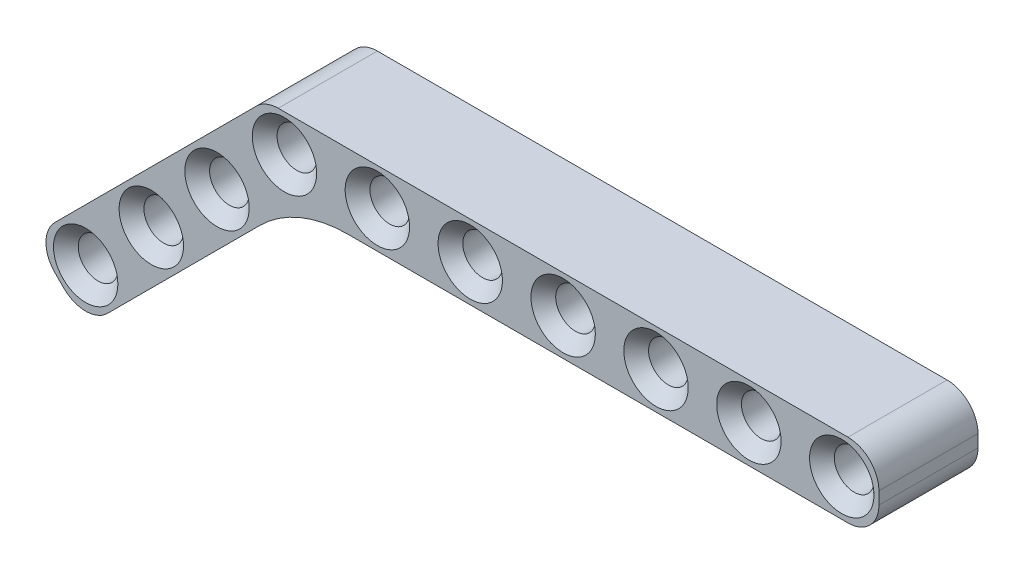
ISO-10303-21;
HEADER;
FILE_DESCRIPTION(('STEP AP214'),'2;1');
FILE_NAME('part.step','',(''),(''),'','','');
FILE_SCHEMA(('AUTOMOTIVE_DESIGN { 1 0 10303 214 1 1 1 1 }'));
ENDSEC;
DATA;
#1=APPLICATION_CONTEXT('core data for automotive mechanical design processes');
#2=APPLICATION_PROTOCOL_DEFINITION('international standard','automotive_design',2000,#1);
#3=PRODUCT_CONTEXT('',#1,'mechanical');
#4=PRODUCT('Part','Part','',(#3));
#5=PRODUCT_RELATED_PRODUCT_CATEGORY('part','',(#4));
#6=PRODUCT_DEFINITION_FORMATION('','',#4);
#7=PRODUCT_DEFINITION_CONTEXT('part definition',#1,'design');
#8=PRODUCT_DEFINITION('design','',#6,#7);
#9=PRODUCT_DEFINITION_SHAPE('','',#8);
#10=(LENGTH_UNIT() NAMED_UNIT(*) SI_UNIT(.MILLI.,.METRE.));
#11=(NAMED_UNIT(*) PLANE_ANGLE_UNIT() SI_UNIT($,.RADIAN.));
#12=(NAMED_UNIT(*) SI_UNIT($,.STERADIAN.) SOLID_ANGLE_UNIT());
#13=UNCERTAINTY_MEASURE_WITH_UNIT(LENGTH_MEASURE(1.E-05),#10,'distance_accuracy_value','');
#14=(GEOMETRIC_REPRESENTATION_CONTEXT(3) GLOBAL_UNCERTAINTY_ASSIGNED_CONTEXT((#13)) GLOBAL_UNIT_ASSIGNED_CONTEXT((#10,
#11,#12)) REPRESENTATION_CONTEXT('',''));
#15=CARTESIAN_POINT('',(0.,0.,0.));
#16=DIRECTION('',(0.,0.,1.));
#17=DIRECTION('',(1.,0.,0.));
#18=AXIS2_PLACEMENT_3D('',#15,#16,#17);
#19=CARTESIAN_POINT('',(-0.5,0.5,8.));
#20=DIRECTION('',(0.,0.,-1.));
#21=DIRECTION('',(-1.,0.,0.));
#22=AXIS2_PLACEMENT_3D('',#19,#20,#21);
#23=CYLINDRICAL_SURFACE('',#22,2.5);
#24=DIRECTION('',(0.,0.,1.));
#25=VECTOR('',#24,1.);
#26=CARTESIAN_POINT('',(-2.26776695296637,2.26776695296637,0.));
#27=LINE('',#26,#25);
#28=CARTESIAN_POINT('',(-2.26776695296637,2.26776695296637,0.));
#29=VERTEX_POINT('',#28);
#30=CARTESIAN_POINT('',(-2.26776695296637,2.26776695296637,8.));
#31=VERTEX_POINT('',#30);
#32=EDGE_CURVE('E172',#29,#31,#27,.T.);
#33=ORIENTED_EDGE('',*,*,#32,.T.);
#34=CARTESIAN_POINT('',(-0.5,0.5,8.));
#35=DIRECTION('',(0.,0.,1.));
#36=DIRECTION('',(1.,0.,0.));
#37=AXIS2_PLACEMENT_3D('',#34,#35,#36);
#38=CIRCLE('',#37,2.5);
#39=CARTESIAN_POINT('',(-0.5,3.,8.));
#40=VERTEX_POINT('',#39);
#41=EDGE_CURVE('E186',#40,#31,#38,.T.);
#42=ORIENTED_EDGE('',*,*,#41,.F.);
#43=DIRECTION('',(0.,0.,-1.));
#44=VECTOR('',#43,1.);
#45=CARTESIAN_POINT('',(-0.5,3.,8.));
#46=LINE('',#45,#44);
#47=CARTESIAN_POINT('',(-0.5,3.,0.));
#48=VERTEX_POINT('',#47);
#49=EDGE_CURVE('E206',#40,#48,#46,.T.);
#50=ORIENTED_EDGE('',*,*,#49,.T.);
#51=CARTESIAN_POINT('',(-0.5,0.5,0.));
#52=DIRECTION('',(0.,0.,1.));
#53=DIRECTION('',(1.,0.,0.));
#54=AXIS2_PLACEMENT_3D('',#51,#52,#53);
#55=CIRCLE('',#54,2.5);
#56=EDGE_CURVE('E200',#48,#29,#55,.T.);
#57=ORIENTED_EDGE('',*,*,#56,.T.);
#58=EDGE_LOOP('',(#33,#42,#50,#57));
#59=FACE_BOUND('',#58,.T.);
#60=ADVANCED_FACE('F35',(#59),#23,.T.);
#61=CARTESIAN_POINT('',(45.5,-0.5,8.));
#62=DIRECTION('',(0.,0.,1.));
#63=DIRECTION('',(1.,0.,0.));
#64=AXIS2_PLACEMENT_3D('',#61,#62,#63);
#65=PLANE('',#64);
#66=CARTESIAN_POINT('',(45.,0.,8.));
#67=DIRECTION('',(0.,0.,1.));
#68=DIRECTION('',(1.,0.,0.));
#69=AXIS2_PLACEMENT_3D('',#66,#67,#68);
#70=CIRCLE('',#69,2.6);
#71=CARTESIAN_POINT('',(47.6,0.,8.));
#72=VERTEX_POINT('',#71);
#73=EDGE_CURVE('E336',#72,#72,#70,.F.);
#74=ORIENTED_EDGE('',*,*,#73,.T.);
#75=EDGE_LOOP('',(#74));
#76=FACE_BOUND('',#75,.T.);
#77=CARTESIAN_POINT('',(37.5,0.,8.));
#78=DIRECTION('',(0.,0.,1.));
#79=DIRECTION('',(1.,0.,0.));
#80=AXIS2_PLACEMENT_3D('',#77,#78,#79);
#81=CIRCLE('',#80,2.6);
#82=CARTESIAN_POINT('',(40.1,0.,8.));
#83=VERTEX_POINT('',#82);
#84=EDGE_CURVE('E333',#83,#83,#81,.F.);
#85=ORIENTED_EDGE('',*,*,#84,.T.);
#86=EDGE_LOOP('',(#85));
#87=FACE_BOUND('',#86,.T.);
#88=CARTESIAN_POINT('',(-16.0543267947628,-15.7614335759495,8.));
#89=DIRECTION('',(0.,0.,1.));
#90=DIRECTION('',(1.,0.,0.));
#91=AXIS2_PLACEMENT_3D('',#88,#89,#90);
#92=CIRCLE('',#91,2.6);
#93=CARTESIAN_POINT('',(-13.4543267947628,-15.7614335759495,8.));
#94=VERTEX_POINT('',#93);
#95=EDGE_CURVE('E297',#94,#94,#92,.F.);
#96=ORIENTED_EDGE('',*,*,#95,.T.);
#97=EDGE_LOOP('',(#96));
#98=FACE_BOUND('',#97,.T.);
#99=CARTESIAN_POINT('',(-10.7510259358637,-10.4581327170504,8.));
#100=DIRECTION('',(0.,0.,1.));
#101=DIRECTION('',(1.,0.,0.));
#102=AXIS2_PLACEMENT_3D('',#99,#100,#101);
#103=CIRCLE('',#102,2.6);
#104=CARTESIAN_POINT('',(-8.15102593586369,-10.4581327170504,8.));
#105=VERTEX_POINT('',#104);
#106=EDGE_CURVE('E294',#105,#105,#103,.F.);
#107=ORIENTED_EDGE('',*,*,#106,.T.);
#108=EDGE_LOOP('',(#107));
#109=FACE_BOUND('',#108,.T.);
#110=CARTESIAN_POINT('',(-5.44772507696464,-5.15483185815121,8.));
#111=DIRECTION('',(0.,0.,1.));
#112=DIRECTION('',(1.,0.,0.));
#113=AXIS2_PLACEMENT_3D('',#110,#111,#112);
#114=CIRCLE('',#113,2.60000000000002);
#115=CARTESIAN_POINT('',(-2.84772507696462,-5.15483185815121,8.));
#116=VERTEX_POINT('',#115);
#117=EDGE_CURVE('E291',#116,#116,#114,.F.);
#118=ORIENTED_EDGE('',*,*,#117,.T.);
#119=EDGE_LOOP('',(#118));
#120=FACE_BOUND('',#119,.T.);
#121=CARTESIAN_POINT('',(30.,0.,8.));
#122=DIRECTION('',(0.,0.,1.));
#123=DIRECTION('',(1.,0.,0.));
#124=AXIS2_PLACEMENT_3D('',#121,#122,#123);
#125=CIRCLE('',#124,2.6);
#126=CARTESIAN_POINT('',(32.6,0.,8.));
#127=VERTEX_POINT('',#126);
#128=EDGE_CURVE('E251',#127,#127,#125,.F.);
#129=ORIENTED_EDGE('',*,*,#128,.T.);
#130=EDGE_LOOP('',(#129));
#131=FACE_BOUND('',#130,.T.);
#132=CARTESIAN_POINT('',(22.5,0.,8.));
#133=DIRECTION('',(0.,0.,1.));
#134=DIRECTION('',(1.,0.,0.));
#135=AXIS2_PLACEMENT_3D('',#132,#133,#134);
#136=CIRCLE('',#135,2.6);
#137=CARTESIAN_POINT('',(25.1,0.,8.));
#138=VERTEX_POINT('',#137);
#139=EDGE_CURVE('E248',#138,#138,#136,.F.);
#140=ORIENTED_EDGE('',*,*,#139,.T.);
#141=EDGE_LOOP('',(#140));
#142=FACE_BOUND('',#141,.T.);
#143=CARTESIAN_POINT('',(15.,0.,8.));
#144=DIRECTION('',(0.,0.,1.));
#145=DIRECTION('',(1.,0.,0.));
#146=AXIS2_PLACEMENT_3D('',#143,#144,#145);
#147=CIRCLE('',#146,2.6);
#148=CARTESIAN_POINT('',(17.6,0.,8.));
#149=VERTEX_POINT('',#148);
#150=EDGE_CURVE('E245',#149,#149,#147,.F.);
#151=ORIENTED_EDGE('',*,*,#150,.T.);
#152=EDGE_LOOP('',(#151));
#153=FACE_BOUND('',#152,.T.);
#154=CARTESIAN_POINT('',(7.5,0.,8.));
#155=DIRECTION('',(0.,0.,1.));
#156=DIRECTION('',(1.,0.,0.));
#157=AXIS2_PLACEMENT_3D('',#154,#155,#156);
#158=CIRCLE('',#157,2.60000000000001);
#159=CARTESIAN_POINT('',(10.1,0.,8.));
#160=VERTEX_POINT('',#159);
#161=EDGE_CURVE('E242',#160,#160,#158,.F.);
#162=ORIENTED_EDGE('',*,*,#161,.T.);
#163=EDGE_LOOP('',(#162));
#164=FACE_BOUND('',#163,.T.);
#165=CARTESIAN_POINT('',(0.,0.,8.));
#166=DIRECTION('',(0.,0.,1.));
#167=DIRECTION('',(1.,0.,0.));
#168=AXIS2_PLACEMENT_3D('',#165,#166,#167);
#169=CIRCLE('',#168,2.60000000000001);
#170=CARTESIAN_POINT('',(2.60000000000001,0.,8.));
#171=VERTEX_POINT('',#170);
#172=EDGE_CURVE('E239',#171,#171,#169,.F.);
#173=ORIENTED_EDGE('',*,*,#172,.T.);
#174=EDGE_LOOP('',(#173));
#175=FACE_BOUND('',#174,.T.);
#176=CARTESIAN_POINT('',(45.5,-0.5,8.));
#177=DIRECTION('',(0.,0.,1.));
#178=DIRECTION('',(1.,0.,0.));
#179=AXIS2_PLACEMENT_3D('',#176,#177,#178);
#180=CIRCLE('',#179,2.5);
#181=CARTESIAN_POINT('',(45.5,-3.,8.));
#182=VERTEX_POINT('',#181);
#183=CARTESIAN_POINT('',(48.,-0.5,8.));
#184=VERTEX_POINT('',#183);
#185=EDGE_CURVE('E176',#182,#184,#180,.T.);
#186=ORIENTED_EDGE('',*,*,#185,.T.);
#187=DIRECTION('',(0.,1.,0.));
#188=VECTOR('',#187,1.);
#189=CARTESIAN_POINT('',(48.,0.5,8.));
#190=LINE('',#189,#188);
#191=CARTESIAN_POINT('',(48.,0.5,8.));
#192=VERTEX_POINT('',#191);
#193=EDGE_CURVE('E179',#184,#192,#190,.T.);
#194=ORIENTED_EDGE('',*,*,#193,.T.);
#195=CARTESIAN_POINT('',(45.5,0.5,8.));
#196=DIRECTION('',(0.,0.,1.));
#197=DIRECTION('',(-1.,0.,0.));
#198=AXIS2_PLACEMENT_3D('',#195,#196,#197);
#199=CIRCLE('',#198,2.5);
#200=CARTESIAN_POINT('',(45.5,3.,8.));
#201=VERTEX_POINT('',#200);
#202=EDGE_CURVE('E182',#192,#201,#199,.T.);
#203=ORIENTED_EDGE('',*,*,#202,.T.);
#204=DIRECTION('',(-1.,0.,0.));
#205=VECTOR('',#204,1.);
#206=CARTESIAN_POINT('',(-0.5,3.,8.));
#207=LINE('',#206,#205);
#208=EDGE_CURVE('E184',#201,#40,#207,.T.);
#209=ORIENTED_EDGE('',*,*,#208,.T.);
#210=ORIENTED_EDGE('',*,*,#41,.T.);
#211=DIRECTION('',(-0.707106781186546,-0.707106781186549,0.));
#212=VECTOR('',#211,1.);
#213=CARTESIAN_POINT('',(-2.26776695296637,2.26776695296636,8.));
#214=LINE('',#213,#212);
#215=CARTESIAN_POINT('',(-18.5292005289157,-13.9936666229831,8.));
#216=VERTEX_POINT('',#215);
#217=EDGE_CURVE('E153',#31,#216,#214,.T.);
#218=ORIENTED_EDGE('',*,*,#217,.T.);
#219=CARTESIAN_POINT('',(-16.7614335759494,-15.7614335759494,8.));
#220=DIRECTION('',(0.,0.,1.));
#221=DIRECTION('',(1.,0.,0.));
#222=AXIS2_PLACEMENT_3D('',#219,#220,#221);
#223=CIRCLE('',#222,2.5);
#224=CARTESIAN_POINT('',(-18.5292005289157,-17.5292005289158,8.));
#225=VERTEX_POINT('',#224);
#226=EDGE_CURVE('E150',#216,#225,#223,.T.);
#227=ORIENTED_EDGE('',*,*,#226,.T.);
#228=DIRECTION('',(0.707106781186546,-0.707106781186549,0.));
#229=VECTOR('',#228,1.);
#230=CARTESIAN_POINT('',(-18.0292005289158,-18.0292005289157,8.));
#231=LINE('',#230,#229);
#232=CARTESIAN_POINT('',(-17.8220937477292,-18.2363073101024,8.));
#233=VERTEX_POINT('',#232);
#234=EDGE_CURVE('E161',#225,#233,#231,.T.);
#235=ORIENTED_EDGE('',*,*,#234,.T.);
#236=CARTESIAN_POINT('',(-16.0543267947628,-16.468540357136,8.));
#237=DIRECTION('',(0.,0.,1.));
#238=DIRECTION('',(1.,0.,0.));
#239=AXIS2_PLACEMENT_3D('',#236,#237,#238);
#240=CIRCLE('',#239,2.5);
#241=CARTESIAN_POINT('',(-14.2865598417965,-18.2363073101024,8.));
#242=VERTEX_POINT('',#241);
#243=EDGE_CURVE('E129',#233,#242,#240,.T.);
#244=ORIENTED_EDGE('',*,*,#243,.T.);
#245=DIRECTION('',(0.707106781186546,0.707106781186549,0.));
#246=VECTOR('',#245,1.);
#247=CARTESIAN_POINT('',(1.97487373415292,-1.97487373415292,8.));
#248=LINE('',#247,#246);
#249=CARTESIAN_POINT('',(-1.97918471982868,-5.92893218813454,8.));
#250=VERTEX_POINT('',#249);
#251=EDGE_CURVE('E164',#242,#250,#248,.T.);
#252=ORIENTED_EDGE('',*,*,#251,.T.);
#253=CARTESIAN_POINT('',(5.09188309203681,-13.,8.));
#254=DIRECTION('',(0.,0.,1.));
#255=DIRECTION('',(1.,0.,0.));
#256=AXIS2_PLACEMENT_3D('',#253,#254,#255);
#257=CIRCLE('',#256,10.);
#258=CARTESIAN_POINT('',(5.09188309203681,-3.,8.));
#259=VERTEX_POINT('',#258);
#260=EDGE_CURVE('E58',#250,#259,#257,.F.);
#261=ORIENTED_EDGE('',*,*,#260,.T.);
#262=DIRECTION('',(1.,0.,0.));
#263=VECTOR('',#262,1.);
#264=CARTESIAN_POINT('',(-0.5,-3.,8.));
#265=LINE('',#264,#263);
#266=EDGE_CURVE('E189',#259,#182,#265,.T.);
#267=ORIENTED_EDGE('',*,*,#266,.T.);
#268=EDGE_LOOP('',(#186,#194,#203,#209,#210,#218,#227,#235,#244,#252,#261,#267));
#269=FACE_BOUND('',#268,.T.);
#270=ADVANCED_FACE('F353',(#76,#87,#98,#109,#120,#131,#142,#153,#164,#175,#269),#65,.T.);
#271=CARTESIAN_POINT('',(45.5,-0.5,0.));
#272=DIRECTION('',(0.,0.,1.));
#273=DIRECTION('',(1.,0.,0.));
#274=AXIS2_PLACEMENT_3D('',#271,#272,#273);
#275=PLANE('',#274);
#276=CARTESIAN_POINT('',(45.,0.,0.));
#277=DIRECTION('',(0.,0.,1.));
#278=DIRECTION('',(1.,0.,0.));
#279=AXIS2_PLACEMENT_3D('',#276,#277,#278);
#280=CIRCLE('',#279,2.6);
#281=CARTESIAN_POINT('',(47.6,0.,0.));
#282=VERTEX_POINT('',#281);
#283=EDGE_CURVE('E324',#282,#282,#280,.T.);
#284=ORIENTED_EDGE('',*,*,#283,.T.);
#285=EDGE_LOOP('',(#284));
#286=FACE_BOUND('',#285,.T.);
#287=CARTESIAN_POINT('',(37.5,0.,0.));
#288=DIRECTION('',(0.,0.,1.));
#289=DIRECTION('',(1.,0.,0.));
#290=AXIS2_PLACEMENT_3D('',#287,#288,#289);
#291=CIRCLE('',#290,2.6);
#292=CARTESIAN_POINT('',(40.1,0.,0.));
#293=VERTEX_POINT('',#292);
#294=EDGE_CURVE('E321',#293,#293,#291,.T.);
#295=ORIENTED_EDGE('',*,*,#294,.T.);
#296=EDGE_LOOP('',(#295));
#297=FACE_BOUND('',#296,.T.);
#298=CARTESIAN_POINT('',(-16.0543267947628,-15.7614335759495,0.));
#299=DIRECTION('',(0.,0.,1.));
#300=DIRECTION('',(1.,0.,0.));
#301=AXIS2_PLACEMENT_3D('',#298,#299,#300);
#302=CIRCLE('',#301,2.6);
#303=CARTESIAN_POINT('',(-13.4543267947628,-15.7614335759495,0.));
#304=VERTEX_POINT('',#303);
#305=EDGE_CURVE('E306',#304,#304,#302,.T.);
#306=ORIENTED_EDGE('',*,*,#305,.T.);
#307=EDGE_LOOP('',(#306));
#308=FACE_BOUND('',#307,.T.);
#309=CARTESIAN_POINT('',(-10.7510259358637,-10.4581327170504,0.));
#310=DIRECTION('',(0.,0.,1.));
#311=DIRECTION('',(1.,0.,0.));
#312=AXIS2_PLACEMENT_3D('',#309,#310,#311);
#313=CIRCLE('',#312,2.6);
#314=CARTESIAN_POINT('',(-8.1510259358637,-10.4581327170504,0.));
#315=VERTEX_POINT('',#314);
#316=EDGE_CURVE('E303',#315,#315,#313,.T.);
#317=ORIENTED_EDGE('',*,*,#316,.T.);
#318=EDGE_LOOP('',(#317));
#319=FACE_BOUND('',#318,.T.);
#320=CARTESIAN_POINT('',(-5.44772507696464,-5.15483185815121,0.));
#321=DIRECTION('',(0.,0.,1.));
#322=DIRECTION('',(1.,0.,0.));
#323=AXIS2_PLACEMENT_3D('',#320,#321,#322);
#324=CIRCLE('',#323,2.6);
#325=CARTESIAN_POINT('',(-2.84772507696464,-5.15483185815121,0.));
#326=VERTEX_POINT('',#325);
#327=EDGE_CURVE('E300',#326,#326,#324,.T.);
#328=ORIENTED_EDGE('',*,*,#327,.T.);
#329=EDGE_LOOP('',(#328));
#330=FACE_BOUND('',#329,.T.);
#331=CARTESIAN_POINT('',(30.,0.,0.));
#332=DIRECTION('',(0.,0.,1.));
#333=DIRECTION('',(1.,0.,0.));
#334=AXIS2_PLACEMENT_3D('',#331,#332,#333);
#335=CIRCLE('',#334,2.6);
#336=CARTESIAN_POINT('',(32.6,0.,0.));
#337=VERTEX_POINT('',#336);
#338=EDGE_CURVE('E230',#337,#337,#335,.T.);
#339=ORIENTED_EDGE('',*,*,#338,.T.);
#340=EDGE_LOOP('',(#339));
#341=FACE_BOUND('',#340,.T.);
#342=CARTESIAN_POINT('',(22.5,0.,0.));
#343=DIRECTION('',(0.,0.,1.));
#344=DIRECTION('',(1.,0.,0.));
#345=AXIS2_PLACEMENT_3D('',#342,#343,#344);
#346=CIRCLE('',#345,2.6);
#347=CARTESIAN_POINT('',(25.1,0.,0.));
#348=VERTEX_POINT('',#347);
#349=EDGE_CURVE('E227',#348,#348,#346,.T.);
#350=ORIENTED_EDGE('',*,*,#349,.T.);
#351=EDGE_LOOP('',(#350));
#352=FACE_BOUND('',#351,.T.);
#353=CARTESIAN_POINT('',(15.,0.,0.));
#354=DIRECTION('',(0.,0.,1.));
#355=DIRECTION('',(1.,0.,0.));
#356=AXIS2_PLACEMENT_3D('',#353,#354,#355);
#357=CIRCLE('',#356,2.6);
#358=CARTESIAN_POINT('',(17.6,0.,0.));
#359=VERTEX_POINT('',#358);
#360=EDGE_CURVE('E224',#359,#359,#357,.T.);
#361=ORIENTED_EDGE('',*,*,#360,.T.);
#362=EDGE_LOOP('',(#361));
#363=FACE_BOUND('',#362,.T.);
#364=CARTESIAN_POINT('',(7.5,0.,0.));
#365=DIRECTION('',(0.,0.,1.));
#366=DIRECTION('',(1.,0.,0.));
#367=AXIS2_PLACEMENT_3D('',#364,#365,#366);
#368=CIRCLE('',#367,2.59999999999999);
#369=CARTESIAN_POINT('',(10.1,0.,0.));
#370=VERTEX_POINT('',#369);
#371=EDGE_CURVE('E221',#370,#370,#368,.T.);
#372=ORIENTED_EDGE('',*,*,#371,.T.);
#373=EDGE_LOOP('',(#372));
#374=FACE_BOUND('',#373,.T.);
#375=CARTESIAN_POINT('',(0.,0.,0.));
#376=DIRECTION('',(0.,0.,1.));
#377=DIRECTION('',(1.,0.,0.));
#378=AXIS2_PLACEMENT_3D('',#375,#376,#377);
#379=CIRCLE('',#378,2.59999999999999);
#380=CARTESIAN_POINT('',(2.59999999999999,0.,0.));
#381=VERTEX_POINT('',#380);
#382=EDGE_CURVE('E218',#381,#381,#379,.T.);
#383=ORIENTED_EDGE('',*,*,#382,.T.);
#384=EDGE_LOOP('',(#383));
#385=FACE_BOUND('',#384,.T.);
#386=CARTESIAN_POINT('',(45.5,-0.5,0.));
#387=DIRECTION('',(0.,0.,1.));
#388=DIRECTION('',(1.,0.,0.));
#389=AXIS2_PLACEMENT_3D('',#386,#387,#388);
#390=CIRCLE('',#389,2.5);
#391=CARTESIAN_POINT('',(45.5,-3.,0.));
#392=VERTEX_POINT('',#391);
#393=CARTESIAN_POINT('',(48.,-0.5,0.));
#394=VERTEX_POINT('',#393);
#395=EDGE_CURVE('E169',#392,#394,#390,.T.);
#396=ORIENTED_EDGE('',*,*,#395,.F.);
#397=DIRECTION('',(1.,0.,0.));
#398=VECTOR('',#397,1.);
#399=CARTESIAN_POINT('',(-0.5,-3.,0.));
#400=LINE('',#399,#398);
#401=CARTESIAN_POINT('',(5.09188309203681,-3.,0.));
#402=VERTEX_POINT('',#401);
#403=EDGE_CURVE('E180',#402,#392,#400,.T.);
#404=ORIENTED_EDGE('',*,*,#403,.F.);
#405=CARTESIAN_POINT('',(5.09188309203681,-13.,0.));
#406=DIRECTION('',(0.,0.,1.));
#407=DIRECTION('',(1.,0.,0.));
#408=AXIS2_PLACEMENT_3D('',#405,#406,#407);
#409=CIRCLE('',#408,10.);
#410=CARTESIAN_POINT('',(-1.97918471982868,-5.92893218813454,0.));
#411=VERTEX_POINT('',#410);
#412=EDGE_CURVE('E283',#402,#411,#409,.T.);
#413=ORIENTED_EDGE('',*,*,#412,.T.);
#414=DIRECTION('',(0.707106781186546,0.707106781186549,0.));
#415=VECTOR('',#414,1.);
#416=CARTESIAN_POINT('',(1.97487373415292,-1.97487373415292,0.));
#417=LINE('',#416,#415);
#418=CARTESIAN_POINT('',(-14.2865598417965,-18.2363073101024,0.));
#419=VERTEX_POINT('',#418);
#420=EDGE_CURVE('E146',#419,#411,#417,.T.);
#421=ORIENTED_EDGE('',*,*,#420,.F.);
#422=CARTESIAN_POINT('',(-16.0543267947628,-16.468540357136,0.));
#423=DIRECTION('',(0.,0.,1.));
#424=DIRECTION('',(1.,0.,0.));
#425=AXIS2_PLACEMENT_3D('',#422,#423,#424);
#426=CIRCLE('',#425,2.5);
#427=CARTESIAN_POINT('',(-17.8220937477292,-18.2363073101024,0.));
#428=VERTEX_POINT('',#427);
#429=EDGE_CURVE('E127',#428,#419,#426,.T.);
#430=ORIENTED_EDGE('',*,*,#429,.F.);
#431=DIRECTION('',(0.707106781186546,-0.707106781186549,0.));
#432=VECTOR('',#431,1.);
#433=CARTESIAN_POINT('',(-18.0292005289158,-18.0292005289157,0.));
#434=LINE('',#433,#432);
#435=CARTESIAN_POINT('',(-18.5292005289157,-17.5292005289158,0.));
#436=VERTEX_POINT('',#435);
#437=EDGE_CURVE('E143',#436,#428,#434,.T.);
#438=ORIENTED_EDGE('',*,*,#437,.F.);
#439=CARTESIAN_POINT('',(-16.7614335759494,-15.7614335759494,0.));
#440=DIRECTION('',(0.,0.,1.));
#441=DIRECTION('',(1.,0.,0.));
#442=AXIS2_PLACEMENT_3D('',#439,#440,#441);
#443=CIRCLE('',#442,2.5);
#444=CARTESIAN_POINT('',(-18.5292005289157,-13.9936666229831,0.));
#445=VERTEX_POINT('',#444);
#446=EDGE_CURVE('E135',#445,#436,#443,.T.);
#447=ORIENTED_EDGE('',*,*,#446,.F.);
#448=DIRECTION('',(-0.707106781186546,-0.707106781186549,0.));
#449=VECTOR('',#448,1.);
#450=CARTESIAN_POINT('',(-2.26776695296637,2.26776695296636,0.));
#451=LINE('',#450,#449);
#452=EDGE_CURVE('E157',#29,#445,#451,.T.);
#453=ORIENTED_EDGE('',*,*,#452,.F.);
#454=ORIENTED_EDGE('',*,*,#56,.F.);
#455=DIRECTION('',(-1.,0.,0.));
#456=VECTOR('',#455,1.);
#457=CARTESIAN_POINT('',(-0.5,3.,0.));
#458=LINE('',#457,#456);
#459=CARTESIAN_POINT('',(45.5,3.,0.));
#460=VERTEX_POINT('',#459);
#461=EDGE_CURVE('E198',#460,#48,#458,.T.);
#462=ORIENTED_EDGE('',*,*,#461,.F.);
#463=CARTESIAN_POINT('',(45.5,0.5,0.));
#464=DIRECTION('',(0.,0.,1.));
#465=DIRECTION('',(-1.,0.,0.));
#466=AXIS2_PLACEMENT_3D('',#463,#464,#465);
#467=CIRCLE('',#466,2.5);
#468=CARTESIAN_POINT('',(48.,0.5,0.));
#469=VERTEX_POINT('',#468);
#470=EDGE_CURVE('E196',#469,#460,#467,.T.);
#471=ORIENTED_EDGE('',*,*,#470,.F.);
#472=DIRECTION('',(0.,1.,0.));
#473=VECTOR('',#472,1.);
#474=CARTESIAN_POINT('',(48.,0.5,0.));
#475=LINE('',#474,#473);
#476=EDGE_CURVE('E194',#394,#469,#475,.T.);
#477=ORIENTED_EDGE('',*,*,#476,.F.);
#478=EDGE_LOOP('',(#396,#404,#413,#421,#430,#438,#447,#453,#454,#462,#471,#477));
#479=FACE_BOUND('',#478,.T.);
#480=ADVANCED_FACE('F141',(#286,#297,#308,#319,#330,#341,#352,#363,#374,#385,#479),#275,.F.);
#481=CARTESIAN_POINT('',(45.5,-0.5,8.));
#482=DIRECTION('',(0.,0.,-1.));
#483=DIRECTION('',(-1.,0.,0.));
#484=AXIS2_PLACEMENT_3D('',#481,#482,#483);
#485=CYLINDRICAL_SURFACE('',#484,2.5);
#486=ORIENTED_EDGE('',*,*,#395,.T.);
#487=DIRECTION('',(0.,0.,-1.));
#488=VECTOR('',#487,1.);
#489=CARTESIAN_POINT('',(48.,-0.5,8.));
#490=LINE('',#489,#488);
#491=EDGE_CURVE('E215',#184,#394,#490,.T.);
#492=ORIENTED_EDGE('',*,*,#491,.F.);
#493=ORIENTED_EDGE('',*,*,#185,.F.);
#494=DIRECTION('',(0.,0.,-1.));
#495=VECTOR('',#494,1.);
#496=CARTESIAN_POINT('',(45.5,-3.,8.));
#497=LINE('',#496,#495);
#498=EDGE_CURVE('E191',#182,#392,#497,.T.);
#499=ORIENTED_EDGE('',*,*,#498,.T.);
#500=EDGE_LOOP('',(#486,#492,#493,#499));
#501=FACE_BOUND('',#500,.T.);
#502=ADVANCED_FACE('F376',(#501),#485,.T.);
#503=CARTESIAN_POINT('',(48.,0.5,8.));
#504=DIRECTION('',(-1.,0.,0.));
#505=DIRECTION('',(0.,0.,1.));
#506=AXIS2_PLACEMENT_3D('',#503,#504,#505);
#507=PLANE('',#506);
#508=ORIENTED_EDGE('',*,*,#476,.T.);
#509=DIRECTION('',(0.,0.,-1.));
#510=VECTOR('',#509,1.);
#511=CARTESIAN_POINT('',(48.,0.5,8.));
#512=LINE('',#511,#510);
#513=EDGE_CURVE('E212',#192,#469,#512,.T.);
#514=ORIENTED_EDGE('',*,*,#513,.F.);
#515=ORIENTED_EDGE('',*,*,#193,.F.);
#516=ORIENTED_EDGE('',*,*,#491,.T.);
#517=EDGE_LOOP('',(#508,#514,#515,#516));
#518=FACE_BOUND('',#517,.T.);
#519=ADVANCED_FACE('F372',(#518),#507,.F.);
#520=CARTESIAN_POINT('',(45.5,0.5,8.));
#521=DIRECTION('',(0.,0.,-1.));
#522=DIRECTION('',(-1.,0.,0.));
#523=AXIS2_PLACEMENT_3D('',#520,#521,#522);
#524=CYLINDRICAL_SURFACE('',#523,2.5);
#525=ORIENTED_EDGE('',*,*,#470,.T.);
#526=DIRECTION('',(0.,0.,-1.));
#527=VECTOR('',#526,1.);
#528=CARTESIAN_POINT('',(45.5,3.,8.));
#529=LINE('',#528,#527);
#530=EDGE_CURVE('E209',#201,#460,#529,.T.);
#531=ORIENTED_EDGE('',*,*,#530,.F.);
#532=ORIENTED_EDGE('',*,*,#202,.F.);
#533=ORIENTED_EDGE('',*,*,#513,.T.);
#534=EDGE_LOOP('',(#525,#531,#532,#533));
#535=FACE_BOUND('',#534,.T.);
#536=ADVANCED_FACE('F368',(#535),#524,.T.);
#537=CARTESIAN_POINT('',(-0.5,3.,8.));
#538=DIRECTION('',(0.,-1.,0.));
#539=DIRECTION('',(1.,0.,0.));
#540=AXIS2_PLACEMENT_3D('',#537,#538,#539);
#541=PLANE('',#540);
#542=ORIENTED_EDGE('',*,*,#461,.T.);
#543=ORIENTED_EDGE('',*,*,#49,.F.);
#544=ORIENTED_EDGE('',*,*,#208,.F.);
#545=ORIENTED_EDGE('',*,*,#530,.T.);
#546=EDGE_LOOP('',(#542,#543,#544,#545));
#547=FACE_BOUND('',#546,.T.);
#548=ADVANCED_FACE('F365',(#547),#541,.F.);
#549=CARTESIAN_POINT('',(-0.5,-3.,8.));
#550=DIRECTION('',(0.,1.,0.));
#551=DIRECTION('',(-1.,0.,0.));
#552=AXIS2_PLACEMENT_3D('',#549,#550,#551);
#553=PLANE('',#552);
#554=ORIENTED_EDGE('',*,*,#266,.F.);
#555=DIRECTION('',(0.,0.,1.));
#556=VECTOR('',#555,1.);
#557=CARTESIAN_POINT('',(5.09188309203681,-3.,8.));
#558=LINE('',#557,#556);
#559=EDGE_CURVE('E50',#259,#402,#558,.F.);
#560=ORIENTED_EDGE('',*,*,#559,.T.);
#561=ORIENTED_EDGE('',*,*,#403,.T.);
#562=ORIENTED_EDGE('',*,*,#498,.F.);
#563=EDGE_LOOP('',(#554,#560,#561,#562));
#564=FACE_BOUND('',#563,.T.);
#565=ADVANCED_FACE('F363',(#564),#553,.F.);
#566=CARTESIAN_POINT('',(0.,0.,8.));
#567=DIRECTION('',(0.,0.,-1.));
#568=DIRECTION('',(-1.,0.,0.));
#569=AXIS2_PLACEMENT_3D('',#566,#567,#568);
#570=CYLINDRICAL_SURFACE('',#569,1.6);
#571=CARTESIAN_POINT('',(0.,0.,0.999999999999992));
#572=DIRECTION('',(0.,0.,1.));
#573=DIRECTION('',(1.,0.,0.));
#574=AXIS2_PLACEMENT_3D('',#571,#572,#573);
#575=CIRCLE('',#574,1.6);
#576=CARTESIAN_POINT('',(1.6,0.,0.999999999999992));
#577=VERTEX_POINT('',#576);
#578=EDGE_CURVE('E275',#577,#577,#575,.F.);
#579=ORIENTED_EDGE('',*,*,#578,.T.);
#580=EDGE_LOOP('',(#579));
#581=FACE_BOUND('',#580,.T.);
#582=CARTESIAN_POINT('',(0.,0.,7.));
#583=DIRECTION('',(0.,0.,1.));
#584=DIRECTION('',(1.,0.,0.));
#585=AXIS2_PLACEMENT_3D('',#582,#583,#584);
#586=CIRCLE('',#585,1.6);
#587=CARTESIAN_POINT('',(1.6,0.,7.));
#588=VERTEX_POINT('',#587);
#589=EDGE_CURVE('E272',#588,#588,#586,.T.);
#590=ORIENTED_EDGE('',*,*,#589,.T.);
#591=EDGE_LOOP('',(#590));
#592=FACE_BOUND('',#591,.T.);
#593=ADVANCED_FACE('F489',(#581,#592),#570,.F.);
#594=CARTESIAN_POINT('',(7.5,0.,8.));
#595=DIRECTION('',(0.,0.,-1.));
#596=DIRECTION('',(-1.,0.,0.));
#597=AXIS2_PLACEMENT_3D('',#594,#595,#596);
#598=CYLINDRICAL_SURFACE('',#597,1.6);
#599=CARTESIAN_POINT('',(7.5,0.,0.99999999999999));
#600=DIRECTION('',(0.,0.,1.));
#601=DIRECTION('',(1.,0.,0.));
#602=AXIS2_PLACEMENT_3D('',#599,#600,#601);
#603=CIRCLE('',#602,1.6);
#604=CARTESIAN_POINT('',(9.1,0.,0.99999999999999));
#605=VERTEX_POINT('',#604);
#606=EDGE_CURVE('E269',#605,#605,#603,.F.);
#607=ORIENTED_EDGE('',*,*,#606,.T.);
#608=EDGE_LOOP('',(#607));
#609=FACE_BOUND('',#608,.T.);
#610=CARTESIAN_POINT('',(7.5,0.,7.));
#611=DIRECTION('',(0.,0.,1.));
#612=DIRECTION('',(1.,0.,0.));
#613=AXIS2_PLACEMENT_3D('',#610,#611,#612);
#614=CIRCLE('',#613,1.6);
#615=CARTESIAN_POINT('',(9.1,0.,7.));
#616=VERTEX_POINT('',#615);
#617=EDGE_CURVE('E266',#616,#616,#614,.T.);
#618=ORIENTED_EDGE('',*,*,#617,.T.);
#619=EDGE_LOOP('',(#618));
#620=FACE_BOUND('',#619,.T.);
#621=ADVANCED_FACE('F485',(#609,#620),#598,.F.);
#622=CARTESIAN_POINT('',(15.,0.,8.));
#623=DIRECTION('',(0.,0.,-1.));
#624=DIRECTION('',(-1.,0.,0.));
#625=AXIS2_PLACEMENT_3D('',#622,#623,#624);
#626=CYLINDRICAL_SURFACE('',#625,1.6);
#627=CARTESIAN_POINT('',(15.,0.,1.00000000000001));
#628=DIRECTION('',(0.,0.,1.));
#629=DIRECTION('',(1.,0.,0.));
#630=AXIS2_PLACEMENT_3D('',#627,#628,#629);
#631=CIRCLE('',#630,1.6);
#632=CARTESIAN_POINT('',(16.6,0.,1.00000000000001));
#633=VERTEX_POINT('',#632);
#634=EDGE_CURVE('E263',#633,#633,#631,.F.);
#635=ORIENTED_EDGE('',*,*,#634,.T.);
#636=EDGE_LOOP('',(#635));
#637=FACE_BOUND('',#636,.T.);
#638=CARTESIAN_POINT('',(15.,0.,7.));
#639=DIRECTION('',(0.,0.,1.));
#640=DIRECTION('',(1.,0.,0.));
#641=AXIS2_PLACEMENT_3D('',#638,#639,#640);
#642=CIRCLE('',#641,1.6);
#643=CARTESIAN_POINT('',(16.6,0.,7.));
#644=VERTEX_POINT('',#643);
#645=EDGE_CURVE('E260',#644,#644,#642,.T.);
#646=ORIENTED_EDGE('',*,*,#645,.T.);
#647=EDGE_LOOP('',(#646));
#648=FACE_BOUND('',#647,.T.);
#649=ADVANCED_FACE('F481',(#637,#648),#626,.F.);
#650=CARTESIAN_POINT('',(22.5,0.,8.));
#651=DIRECTION('',(0.,0.,-1.));
#652=DIRECTION('',(-1.,0.,0.));
#653=AXIS2_PLACEMENT_3D('',#650,#651,#652);
#654=CYLINDRICAL_SURFACE('',#653,1.6);
#655=CARTESIAN_POINT('',(22.5,0.,1.00000000000001));
#656=DIRECTION('',(0.,0.,1.));
#657=DIRECTION('',(1.,0.,0.));
#658=AXIS2_PLACEMENT_3D('',#655,#656,#657);
#659=CIRCLE('',#658,1.6);
#660=CARTESIAN_POINT('',(24.1,0.,1.00000000000001));
#661=VERTEX_POINT('',#660);
#662=EDGE_CURVE('E257',#661,#661,#659,.F.);
#663=ORIENTED_EDGE('',*,*,#662,.T.);
#664=EDGE_LOOP('',(#663));
#665=FACE_BOUND('',#664,.T.);
#666=CARTESIAN_POINT('',(22.5,0.,7.));
#667=DIRECTION('',(0.,0.,1.));
#668=DIRECTION('',(1.,0.,0.));
#669=AXIS2_PLACEMENT_3D('',#666,#667,#668);
#670=CIRCLE('',#669,1.6);
#671=CARTESIAN_POINT('',(24.1,0.,7.));
#672=VERTEX_POINT('',#671);
#673=EDGE_CURVE('E254',#672,#672,#670,.T.);
#674=ORIENTED_EDGE('',*,*,#673,.T.);
#675=EDGE_LOOP('',(#674));
#676=FACE_BOUND('',#675,.T.);
#677=ADVANCED_FACE('F477',(#665,#676),#654,.F.);
#678=CARTESIAN_POINT('',(30.,0.,8.));
#679=DIRECTION('',(0.,0.,-1.));
#680=DIRECTION('',(-1.,0.,0.));
#681=AXIS2_PLACEMENT_3D('',#678,#679,#680);
#682=CYLINDRICAL_SURFACE('',#681,1.6);
#683=CARTESIAN_POINT('',(30.,0.,1.00000000000001));
#684=DIRECTION('',(0.,0.,1.));
#685=DIRECTION('',(1.,0.,0.));
#686=AXIS2_PLACEMENT_3D('',#683,#684,#685);
#687=CIRCLE('',#686,1.6);
#688=CARTESIAN_POINT('',(31.6,0.,1.00000000000001));
#689=VERTEX_POINT('',#688);
#690=EDGE_CURVE('E236',#689,#689,#687,.F.);
#691=ORIENTED_EDGE('',*,*,#690,.T.);
#692=EDGE_LOOP('',(#691));
#693=FACE_BOUND('',#692,.T.);
#694=CARTESIAN_POINT('',(30.,0.,7.));
#695=DIRECTION('',(0.,0.,1.));
#696=DIRECTION('',(1.,0.,0.));
#697=AXIS2_PLACEMENT_3D('',#694,#695,#696);
#698=CIRCLE('',#697,1.6);
#699=CARTESIAN_POINT('',(31.6,0.,7.));
#700=VERTEX_POINT('',#699);
#701=EDGE_CURVE('E233',#700,#700,#698,.T.);
#702=ORIENTED_EDGE('',*,*,#701,.T.);
#703=EDGE_LOOP('',(#702));
#704=FACE_BOUND('',#703,.T.);
#705=ADVANCED_FACE('F468',(#693,#704),#682,.F.);
#706=CARTESIAN_POINT('',(37.5,0.,8.));
#707=DIRECTION('',(0.,0.,-1.));
#708=DIRECTION('',(-1.,0.,0.));
#709=AXIS2_PLACEMENT_3D('',#706,#707,#708);
#710=CYLINDRICAL_SURFACE('',#709,1.6);
#711=CARTESIAN_POINT('',(37.5,0.,1.00000000000001));
#712=DIRECTION('',(0.,0.,1.));
#713=DIRECTION('',(1.,0.,0.));
#714=AXIS2_PLACEMENT_3D('',#711,#712,#713);
#715=CIRCLE('',#714,1.6);
#716=CARTESIAN_POINT('',(39.1,0.,1.00000000000001));
#717=VERTEX_POINT('',#716);
#718=EDGE_CURVE('E11',#717,#717,#715,.F.);
#719=ORIENTED_EDGE('',*,*,#718,.T.);
#720=EDGE_LOOP('',(#719));
#721=FACE_BOUND('',#720,.T.);
#722=CARTESIAN_POINT('',(37.5,0.,6.99999999999999));
#723=DIRECTION('',(0.,0.,1.));
#724=DIRECTION('',(1.,0.,0.));
#725=AXIS2_PLACEMENT_3D('',#722,#723,#724);
#726=CIRCLE('',#725,1.6);
#727=CARTESIAN_POINT('',(39.1,0.,6.99999999999999));
#728=VERTEX_POINT('',#727);
#729=EDGE_CURVE('E43',#728,#728,#726,.T.);
#730=ORIENTED_EDGE('',*,*,#729,.T.);
#731=EDGE_LOOP('',(#730));
#732=FACE_BOUND('',#731,.T.);
#733=ADVANCED_FACE('F341',(#721,#732),#710,.F.);
#734=CARTESIAN_POINT('',(45.,0.,8.));
#735=DIRECTION('',(0.,0.,-1.));
#736=DIRECTION('',(-1.,0.,0.));
#737=AXIS2_PLACEMENT_3D('',#734,#735,#736);
#738=CYLINDRICAL_SURFACE('',#737,1.6);
#739=CARTESIAN_POINT('',(45.,0.,1.00000000000001));
#740=DIRECTION('',(0.,0.,1.));
#741=DIRECTION('',(1.,0.,0.));
#742=AXIS2_PLACEMENT_3D('',#739,#740,#741);
#743=CIRCLE('',#742,1.6);
#744=CARTESIAN_POINT('',(46.6,0.,1.00000000000001));
#745=VERTEX_POINT('',#744);
#746=EDGE_CURVE('E330',#745,#745,#743,.F.);
#747=ORIENTED_EDGE('',*,*,#746,.T.);
#748=EDGE_LOOP('',(#747));
#749=FACE_BOUND('',#748,.T.);
#750=CARTESIAN_POINT('',(45.,0.,6.99999999999999));
#751=DIRECTION('',(0.,0.,1.));
#752=DIRECTION('',(1.,0.,0.));
#753=AXIS2_PLACEMENT_3D('',#750,#751,#752);
#754=CIRCLE('',#753,1.6);
#755=CARTESIAN_POINT('',(46.6,0.,6.99999999999999));
#756=VERTEX_POINT('',#755);
#757=EDGE_CURVE('E327',#756,#756,#754,.T.);
#758=ORIENTED_EDGE('',*,*,#757,.T.);
#759=EDGE_LOOP('',(#758));
#760=FACE_BOUND('',#759,.T.);
#761=ADVANCED_FACE('F385',(#749,#760),#738,.F.);
#762=CARTESIAN_POINT('',(30.,0.,0.));
#763=DIRECTION('',(0.,0.,-1.));
#764=DIRECTION('',(-1.,0.,0.));
#765=AXIS2_PLACEMENT_3D('',#762,#763,#764);
#766=CONICAL_SURFACE('',#765,2.6,0.785398163397444);
#767=ORIENTED_EDGE('',*,*,#690,.F.);
#768=EDGE_LOOP('',(#767));
#769=FACE_BOUND('',#768,.T.);
#770=ORIENTED_EDGE('',*,*,#338,.F.);
#771=EDGE_LOOP('',(#770));
#772=FACE_BOUND('',#771,.T.);
#773=ADVANCED_FACE('F381',(#769,#772),#766,.F.);
#774=CARTESIAN_POINT('',(30.,0.,7.));
#775=DIRECTION('',(0.,0.,1.));
#776=DIRECTION('',(1.,0.,0.));
#777=AXIS2_PLACEMENT_3D('',#774,#775,#776);
#778=CONICAL_SURFACE('',#777,1.6,0.785398163397449);
#779=ORIENTED_EDGE('',*,*,#128,.F.);
#780=EDGE_LOOP('',(#779));
#781=FACE_BOUND('',#780,.T.);
#782=ORIENTED_EDGE('',*,*,#701,.F.);
#783=EDGE_LOOP('',(#782));
#784=FACE_BOUND('',#783,.T.);
#785=ADVANCED_FACE('F384',(#781,#784),#778,.F.);
#786=CARTESIAN_POINT('',(22.5,0.,0.));
#787=DIRECTION('',(0.,0.,-1.));
#788=DIRECTION('',(-1.,0.,0.));
#789=AXIS2_PLACEMENT_3D('',#786,#787,#788);
#790=CONICAL_SURFACE('',#789,2.6,0.785398163397444);
#791=ORIENTED_EDGE('',*,*,#662,.F.);
#792=EDGE_LOOP('',(#791));
#793=FACE_BOUND('',#792,.T.);
#794=ORIENTED_EDGE('',*,*,#349,.F.);
#795=EDGE_LOOP('',(#794));
#796=FACE_BOUND('',#795,.T.);
#797=ADVANCED_FACE('F389',(#793,#796),#790,.F.);
#798=CARTESIAN_POINT('',(22.5,0.,7.));
#799=DIRECTION('',(0.,0.,1.));
#800=DIRECTION('',(1.,0.,0.));
#801=AXIS2_PLACEMENT_3D('',#798,#799,#800);
#802=CONICAL_SURFACE('',#801,1.6,0.785398163397449);
#803=ORIENTED_EDGE('',*,*,#139,.F.);
#804=EDGE_LOOP('',(#803));
#805=FACE_BOUND('',#804,.T.);
#806=ORIENTED_EDGE('',*,*,#673,.F.);
#807=EDGE_LOOP('',(#806));
#808=FACE_BOUND('',#807,.T.);
#809=ADVANCED_FACE('F393',(#805,#808),#802,.F.);
#810=CARTESIAN_POINT('',(15.,0.,0.));
#811=DIRECTION('',(0.,0.,-1.));
#812=DIRECTION('',(-1.,0.,0.));
#813=AXIS2_PLACEMENT_3D('',#810,#811,#812);
#814=CONICAL_SURFACE('',#813,2.6,0.785398163397444);
#815=ORIENTED_EDGE('',*,*,#634,.F.);
#816=EDGE_LOOP('',(#815));
#817=FACE_BOUND('',#816,.T.);
#818=ORIENTED_EDGE('',*,*,#360,.F.);
#819=EDGE_LOOP('',(#818));
#820=FACE_BOUND('',#819,.T.);
#821=ADVANCED_FACE('F397',(#817,#820),#814,.F.);
#822=CARTESIAN_POINT('',(15.,0.,7.));
#823=DIRECTION('',(0.,0.,1.));
#824=DIRECTION('',(1.,0.,0.));
#825=AXIS2_PLACEMENT_3D('',#822,#823,#824);
#826=CONICAL_SURFACE('',#825,1.6,0.785398163397449);
#827=ORIENTED_EDGE('',*,*,#150,.F.);
#828=EDGE_LOOP('',(#827));
#829=FACE_BOUND('',#828,.T.);
#830=ORIENTED_EDGE('',*,*,#645,.F.);
#831=EDGE_LOOP('',(#830));
#832=FACE_BOUND('',#831,.T.);
#833=ADVANCED_FACE('F401',(#829,#832),#826,.F.);
#834=CARTESIAN_POINT('',(7.5,0.,0.));
#835=DIRECTION('',(0.,0.,-1.));
#836=DIRECTION('',(-1.,0.,0.));
#837=AXIS2_PLACEMENT_3D('',#834,#835,#836);
#838=CONICAL_SURFACE('',#837,2.59999999999999,0.785398163397448);
#839=ORIENTED_EDGE('',*,*,#606,.F.);
#840=EDGE_LOOP('',(#839));
#841=FACE_BOUND('',#840,.T.);
#842=ORIENTED_EDGE('',*,*,#371,.F.);
#843=EDGE_LOOP('',(#842));
#844=FACE_BOUND('',#843,.T.);
#845=ADVANCED_FACE('F405',(#841,#844),#838,.F.);
#846=CARTESIAN_POINT('',(7.5,0.,7.));
#847=DIRECTION('',(0.,0.,1.));
#848=DIRECTION('',(1.,0.,0.));
#849=AXIS2_PLACEMENT_3D('',#846,#847,#848);
#850=CONICAL_SURFACE('',#849,1.6,0.785398163397452);
#851=ORIENTED_EDGE('',*,*,#161,.F.);
#852=EDGE_LOOP('',(#851));
#853=FACE_BOUND('',#852,.T.);
#854=ORIENTED_EDGE('',*,*,#617,.F.);
#855=EDGE_LOOP('',(#854));
#856=FACE_BOUND('',#855,.T.);
#857=ADVANCED_FACE('F409',(#853,#856),#850,.F.);
#858=CARTESIAN_POINT('',(0.,0.,0.));
#859=DIRECTION('',(0.,0.,-1.));
#860=DIRECTION('',(-1.,0.,0.));
#861=AXIS2_PLACEMENT_3D('',#858,#859,#860);
#862=CONICAL_SURFACE('',#861,2.59999999999999,0.785398163397448);
#863=ORIENTED_EDGE('',*,*,#578,.F.);
#864=EDGE_LOOP('',(#863));
#865=FACE_BOUND('',#864,.T.);
#866=ORIENTED_EDGE('',*,*,#382,.F.);
#867=EDGE_LOOP('',(#866));
#868=FACE_BOUND('',#867,.T.);
#869=ADVANCED_FACE('F413',(#865,#868),#862,.F.);
#870=CARTESIAN_POINT('',(0.,0.,7.));
#871=DIRECTION('',(0.,0.,1.));
#872=DIRECTION('',(1.,0.,0.));
#873=AXIS2_PLACEMENT_3D('',#870,#871,#872);
#874=CONICAL_SURFACE('',#873,1.6,0.785398163397452);
#875=ORIENTED_EDGE('',*,*,#172,.F.);
#876=EDGE_LOOP('',(#875));
#877=FACE_BOUND('',#876,.T.);
#878=ORIENTED_EDGE('',*,*,#589,.F.);
#879=EDGE_LOOP('',(#878));
#880=FACE_BOUND('',#879,.T.);
#881=ADVANCED_FACE('F417',(#877,#880),#874,.F.);
#882=CARTESIAN_POINT('',(-18.0292005289158,-18.0292005289157,0.));
#883=DIRECTION('',(-0.707106781186549,-0.707106781186546,0.));
#884=DIRECTION('',(0.707106781186546,-0.707106781186549,0.));
#885=AXIS2_PLACEMENT_3D('',#882,#883,#884);
#886=PLANE('',#885);
#887=ORIENTED_EDGE('',*,*,#234,.F.);
#888=DIRECTION('',(0.,0.,1.));
#889=VECTOR('',#888,1.);
#890=CARTESIAN_POINT('',(-18.5292005289157,-17.5292005289158,0.));
#891=LINE('',#890,#889);
#892=EDGE_CURVE('E149',#436,#225,#891,.T.);
#893=ORIENTED_EDGE('',*,*,#892,.F.);
#894=ORIENTED_EDGE('',*,*,#437,.T.);
#895=DIRECTION('',(0.,0.,1.));
#896=VECTOR('',#895,1.);
#897=CARTESIAN_POINT('',(-17.8220937477292,-18.2363073101024,0.));
#898=LINE('',#897,#896);
#899=EDGE_CURVE('E124',#428,#233,#898,.T.);
#900=ORIENTED_EDGE('',*,*,#899,.T.);
#901=EDGE_LOOP('',(#887,#893,#894,#900));
#902=FACE_BOUND('',#901,.T.);
#903=ADVANCED_FACE('F148',(#902),#886,.T.);
#904=CARTESIAN_POINT('',(-16.7614335759494,-15.7614335759494,0.));
#905=DIRECTION('',(0.,0.,1.));
#906=DIRECTION('',(1.,0.,0.));
#907=AXIS2_PLACEMENT_3D('',#904,#905,#906);
#908=CYLINDRICAL_SURFACE('',#907,2.5);
#909=ORIENTED_EDGE('',*,*,#226,.F.);
#910=DIRECTION('',(0.,0.,1.));
#911=VECTOR('',#910,1.);
#912=CARTESIAN_POINT('',(-18.5292005289157,-13.9936666229831,0.));
#913=LINE('',#912,#911);
#914=EDGE_CURVE('E170',#445,#216,#913,.T.);
#915=ORIENTED_EDGE('',*,*,#914,.F.);
#916=ORIENTED_EDGE('',*,*,#446,.T.);
#917=ORIENTED_EDGE('',*,*,#892,.T.);
#918=EDGE_LOOP('',(#909,#915,#916,#917));
#919=FACE_BOUND('',#918,.T.);
#920=ADVANCED_FACE('F671',(#919),#908,.T.);
#921=CARTESIAN_POINT('',(-2.26776695296637,2.26776695296636,0.));
#922=DIRECTION('',(-0.707106781186549,0.707106781186546,0.));
#923=DIRECTION('',(-0.707106781186546,-0.707106781186549,0.));
#924=AXIS2_PLACEMENT_3D('',#921,#922,#923);
#925=PLANE('',#924);
#926=ORIENTED_EDGE('',*,*,#217,.F.);
#927=ORIENTED_EDGE('',*,*,#32,.F.);
#928=ORIENTED_EDGE('',*,*,#452,.T.);
#929=ORIENTED_EDGE('',*,*,#914,.T.);
#930=EDGE_LOOP('',(#926,#927,#928,#929));
#931=FACE_BOUND('',#930,.T.);
#932=ADVANCED_FACE('F664',(#931),#925,.T.);
#933=CARTESIAN_POINT('',(1.97487373415292,-1.97487373415292,0.));
#934=DIRECTION('',(0.707106781186549,-0.707106781186546,0.));
#935=DIRECTION('',(0.707106781186546,0.707106781186549,0.));
#936=AXIS2_PLACEMENT_3D('',#933,#934,#935);
#937=PLANE('',#936);
#938=ORIENTED_EDGE('',*,*,#420,.T.);
#939=DIRECTION('',(0.,0.,1.));
#940=VECTOR('',#939,1.);
#941=CARTESIAN_POINT('',(-1.97918471982868,-5.92893218813454,0.));
#942=LINE('',#941,#940);
#943=EDGE_CURVE('E278',#411,#250,#942,.T.);
#944=ORIENTED_EDGE('',*,*,#943,.T.);
#945=ORIENTED_EDGE('',*,*,#251,.F.);
#946=DIRECTION('',(0.,0.,1.));
#947=VECTOR('',#946,1.);
#948=CARTESIAN_POINT('',(-14.2865598417965,-18.2363073101024,0.));
#949=LINE('',#948,#947);
#950=EDGE_CURVE('E134',#419,#242,#949,.T.);
#951=ORIENTED_EDGE('',*,*,#950,.F.);
#952=EDGE_LOOP('',(#938,#944,#945,#951));
#953=FACE_BOUND('',#952,.T.);
#954=ADVANCED_FACE('F657',(#953),#937,.T.);
#955=CARTESIAN_POINT('',(-16.0543267947628,-15.7614335759495,0.));
#956=DIRECTION('',(0.,0.,1.));
#957=DIRECTION('',(1.,0.,0.));
#958=AXIS2_PLACEMENT_3D('',#955,#956,#957);
#959=CYLINDRICAL_SURFACE('',#958,1.6);
#960=CARTESIAN_POINT('',(-16.0543267947628,-15.7614335759495,7.));
#961=DIRECTION('',(0.,0.,1.));
#962=DIRECTION('',(1.,0.,0.));
#963=AXIS2_PLACEMENT_3D('',#960,#961,#962);
#964=CIRCLE('',#963,1.6);
#965=CARTESIAN_POINT('',(-14.4543267947628,-15.7614335759495,7.));
#966=VERTEX_POINT('',#965);
#967=EDGE_CURVE('E288',#966,#966,#964,.T.);
#968=ORIENTED_EDGE('',*,*,#967,.T.);
#969=EDGE_LOOP('',(#968));
#970=FACE_BOUND('',#969,.T.);
#971=CARTESIAN_POINT('',(-16.0543267947628,-15.7614335759495,1.00000000000001));
#972=DIRECTION('',(0.,0.,1.));
#973=DIRECTION('',(1.,0.,0.));
#974=AXIS2_PLACEMENT_3D('',#971,#972,#973);
#975=CIRCLE('',#974,1.6);
#976=CARTESIAN_POINT('',(-14.4543267947628,-15.7614335759495,1.00000000000001));
#977=VERTEX_POINT('',#976);
#978=EDGE_CURVE('E285',#977,#977,#975,.F.);
#979=ORIENTED_EDGE('',*,*,#978,.T.);
#980=EDGE_LOOP('',(#979));
#981=FACE_BOUND('',#980,.T.);
#982=ADVANCED_FACE('F651',(#970,#981),#959,.F.);
#983=CARTESIAN_POINT('',(-10.7510259358637,-10.4581327170504,0.));
#984=DIRECTION('',(0.,0.,1.));
#985=DIRECTION('',(1.,0.,0.));
#986=AXIS2_PLACEMENT_3D('',#983,#984,#985);
#987=CYLINDRICAL_SURFACE('',#986,1.6);
#988=CARTESIAN_POINT('',(-10.7510259358637,-10.4581327170504,7.));
#989=DIRECTION('',(0.,0.,1.));
#990=DIRECTION('',(1.,0.,0.));
#991=AXIS2_PLACEMENT_3D('',#988,#989,#990);
#992=CIRCLE('',#991,1.6);
#993=CARTESIAN_POINT('',(-9.1510259358637,-10.4581327170504,7.));
#994=VERTEX_POINT('',#993);
#995=EDGE_CURVE('E312',#994,#994,#992,.T.);
#996=ORIENTED_EDGE('',*,*,#995,.T.);
#997=EDGE_LOOP('',(#996));
#998=FACE_BOUND('',#997,.T.);
#999=CARTESIAN_POINT('',(-10.7510259358637,-10.4581327170504,1.00000000000001));
#1000=DIRECTION('',(0.,0.,1.));
#1001=DIRECTION('',(1.,0.,0.));
#1002=AXIS2_PLACEMENT_3D('',#999,#1000,#1001);
#1003=CIRCLE('',#1002,1.6);
#1004=CARTESIAN_POINT('',(-9.1510259358637,-10.4581327170504,1.00000000000001));
#1005=VERTEX_POINT('',#1004);
#1006=EDGE_CURVE('E309',#1005,#1005,#1003,.F.);
#1007=ORIENTED_EDGE('',*,*,#1006,.T.);
#1008=EDGE_LOOP('',(#1007));
#1009=FACE_BOUND('',#1008,.T.);
#1010=ADVANCED_FACE('F644',(#998,#1009),#987,.F.);
#1011=CARTESIAN_POINT('',(-5.44772507696464,-5.15483185815121,0.));
#1012=DIRECTION('',(0.,0.,1.));
#1013=DIRECTION('',(1.,0.,0.));
#1014=AXIS2_PLACEMENT_3D('',#1011,#1012,#1013);
#1015=CYLINDRICAL_SURFACE('',#1014,1.6);
#1016=CARTESIAN_POINT('',(-5.44772507696464,-5.15483185815121,6.99999999999999));
#1017=DIRECTION('',(0.,0.,1.));
#1018=DIRECTION('',(1.,0.,0.));
#1019=AXIS2_PLACEMENT_3D('',#1016,#1017,#1018);
#1020=CIRCLE('',#1019,1.6);
#1021=CARTESIAN_POINT('',(-3.84772507696464,-5.15483185815121,6.99999999999999));
#1022=VERTEX_POINT('',#1021);
#1023=EDGE_CURVE('E318',#1022,#1022,#1020,.T.);
#1024=ORIENTED_EDGE('',*,*,#1023,.T.);
#1025=EDGE_LOOP('',(#1024));
#1026=FACE_BOUND('',#1025,.T.);
#1027=CARTESIAN_POINT('',(-5.44772507696464,-5.15483185815121,0.999999999999999));
#1028=DIRECTION('',(0.,0.,1.));
#1029=DIRECTION('',(1.,0.,0.));
#1030=AXIS2_PLACEMENT_3D('',#1027,#1028,#1029);
#1031=CIRCLE('',#1030,1.6);
#1032=CARTESIAN_POINT('',(-3.84772507696464,-5.15483185815121,0.999999999999999));
#1033=VERTEX_POINT('',#1032);
#1034=EDGE_CURVE('E315',#1033,#1033,#1031,.F.);
#1035=ORIENTED_EDGE('',*,*,#1034,.T.);
#1036=EDGE_LOOP('',(#1035));
#1037=FACE_BOUND('',#1036,.T.);
#1038=ADVANCED_FACE('F472',(#1026,#1037),#1015,.F.);
#1039=CARTESIAN_POINT('',(-16.0543267947628,-16.468540357136,0.));
#1040=DIRECTION('',(0.,0.,1.));
#1041=DIRECTION('',(1.,0.,0.));
#1042=AXIS2_PLACEMENT_3D('',#1039,#1040,#1041);
#1043=CYLINDRICAL_SURFACE('',#1042,2.5);
#1044=ORIENTED_EDGE('',*,*,#243,.F.);
#1045=ORIENTED_EDGE('',*,*,#899,.F.);
#1046=ORIENTED_EDGE('',*,*,#429,.T.);
#1047=ORIENTED_EDGE('',*,*,#950,.T.);
#1048=EDGE_LOOP('',(#1044,#1045,#1046,#1047));
#1049=FACE_BOUND('',#1048,.T.);
#1050=ADVANCED_FACE('F126',(#1049),#1043,.T.);
#1051=CARTESIAN_POINT('',(5.09188309203681,-13.,0.));
#1052=DIRECTION('',(0.,0.,1.));
#1053=DIRECTION('',(1.,0.,0.));
#1054=AXIS2_PLACEMENT_3D('',#1051,#1052,#1053);
#1055=CYLINDRICAL_SURFACE('',#1054,10.);
#1056=ORIENTED_EDGE('',*,*,#412,.F.);
#1057=ORIENTED_EDGE('',*,*,#559,.F.);
#1058=ORIENTED_EDGE('',*,*,#260,.F.);
#1059=ORIENTED_EDGE('',*,*,#943,.F.);
#1060=EDGE_LOOP('',(#1056,#1057,#1058,#1059));
#1061=FACE_BOUND('',#1060,.T.);
#1062=ADVANCED_FACE('F422',(#1061),#1055,.F.);
#1063=CARTESIAN_POINT('',(-16.0543267947628,-15.7614335759495,7.));
#1064=DIRECTION('',(0.,0.,1.));
#1065=DIRECTION('',(1.,0.,0.));
#1066=AXIS2_PLACEMENT_3D('',#1063,#1064,#1065);
#1067=CONICAL_SURFACE('',#1066,1.6,0.785398163397452);
#1068=ORIENTED_EDGE('',*,*,#95,.F.);
#1069=EDGE_LOOP('',(#1068));
#1070=FACE_BOUND('',#1069,.T.);
#1071=ORIENTED_EDGE('',*,*,#967,.F.);
#1072=EDGE_LOOP('',(#1071));
#1073=FACE_BOUND('',#1072,.T.);
#1074=ADVANCED_FACE('F425',(#1070,#1073),#1067,.F.);
#1075=CARTESIAN_POINT('',(-16.0543267947628,-15.7614335759495,0.));
#1076=DIRECTION('',(0.,0.,-1.));
#1077=DIRECTION('',(-1.,0.,0.));
#1078=AXIS2_PLACEMENT_3D('',#1075,#1076,#1077);
#1079=CONICAL_SURFACE('',#1078,2.6,0.785398163397444);
#1080=ORIENTED_EDGE('',*,*,#978,.F.);
#1081=EDGE_LOOP('',(#1080));
#1082=FACE_BOUND('',#1081,.T.);
#1083=ORIENTED_EDGE('',*,*,#305,.F.);
#1084=EDGE_LOOP('',(#1083));
#1085=FACE_BOUND('',#1084,.T.);
#1086=ADVANCED_FACE('F429',(#1082,#1085),#1079,.F.);
#1087=CARTESIAN_POINT('',(-10.7510259358637,-10.4581327170504,7.));
#1088=DIRECTION('',(0.,0.,1.));
#1089=DIRECTION('',(1.,0.,0.));
#1090=AXIS2_PLACEMENT_3D('',#1087,#1088,#1089);
#1091=CONICAL_SURFACE('',#1090,1.6,0.785398163397452);
#1092=ORIENTED_EDGE('',*,*,#106,.F.);
#1093=EDGE_LOOP('',(#1092));
#1094=FACE_BOUND('',#1093,.T.);
#1095=ORIENTED_EDGE('',*,*,#995,.F.);
#1096=EDGE_LOOP('',(#1095));
#1097=FACE_BOUND('',#1096,.T.);
#1098=ADVANCED_FACE('F433',(#1094,#1097),#1091,.F.);
#1099=CARTESIAN_POINT('',(-10.7510259358637,-10.4581327170504,0.));
#1100=DIRECTION('',(0.,0.,-1.));
#1101=DIRECTION('',(-1.,0.,0.));
#1102=AXIS2_PLACEMENT_3D('',#1099,#1100,#1101);
#1103=CONICAL_SURFACE('',#1102,2.6,0.785398163397444);
#1104=ORIENTED_EDGE('',*,*,#1006,.F.);
#1105=EDGE_LOOP('',(#1104));
#1106=FACE_BOUND('',#1105,.T.);
#1107=ORIENTED_EDGE('',*,*,#316,.F.);
#1108=EDGE_LOOP('',(#1107));
#1109=FACE_BOUND('',#1108,.T.);
#1110=ADVANCED_FACE('F437',(#1106,#1109),#1103,.F.);
#1111=CARTESIAN_POINT('',(-5.44772507696464,-5.15483185815121,6.99999999999999));
#1112=DIRECTION('',(0.,0.,1.));
#1113=DIRECTION('',(1.,0.,0.));
#1114=AXIS2_PLACEMENT_3D('',#1111,#1112,#1113);
#1115=CONICAL_SURFACE('',#1114,1.6,0.785398163397452);
#1116=ORIENTED_EDGE('',*,*,#117,.F.);
#1117=EDGE_LOOP('',(#1116));
#1118=FACE_BOUND('',#1117,.T.);
#1119=ORIENTED_EDGE('',*,*,#1023,.F.);
#1120=EDGE_LOOP('',(#1119));
#1121=FACE_BOUND('',#1120,.T.);
#1122=ADVANCED_FACE('F441',(#1118,#1121),#1115,.F.);
#1123=CARTESIAN_POINT('',(-5.44772507696464,-5.15483185815121,0.));
#1124=DIRECTION('',(0.,0.,-1.));
#1125=DIRECTION('',(-1.,0.,0.));
#1126=AXIS2_PLACEMENT_3D('',#1123,#1124,#1125);
#1127=CONICAL_SURFACE('',#1126,2.6,0.785398163397447);
#1128=ORIENTED_EDGE('',*,*,#1034,.F.);
#1129=EDGE_LOOP('',(#1128));
#1130=FACE_BOUND('',#1129,.T.);
#1131=ORIENTED_EDGE('',*,*,#327,.F.);
#1132=EDGE_LOOP('',(#1131));
#1133=FACE_BOUND('',#1132,.T.);
#1134=ADVANCED_FACE('F445',(#1130,#1133),#1127,.F.);
#1135=CARTESIAN_POINT('',(45.,0.,0.));
#1136=DIRECTION('',(0.,0.,-1.));
#1137=DIRECTION('',(-1.,0.,0.));
#1138=AXIS2_PLACEMENT_3D('',#1135,#1136,#1137);
#1139=CONICAL_SURFACE('',#1138,2.6,0.785398163397443);
#1140=ORIENTED_EDGE('',*,*,#746,.F.);
#1141=EDGE_LOOP('',(#1140));
#1142=FACE_BOUND('',#1141,.T.);
#1143=ORIENTED_EDGE('',*,*,#283,.F.);
#1144=EDGE_LOOP('',(#1143));
#1145=FACE_BOUND('',#1144,.T.);
#1146=ADVANCED_FACE('F449',(#1142,#1145),#1139,.F.);
#1147=CARTESIAN_POINT('',(45.,0.,6.99999999999999));
#1148=DIRECTION('',(0.,0.,1.));
#1149=DIRECTION('',(1.,0.,0.));
#1150=AXIS2_PLACEMENT_3D('',#1147,#1148,#1149);
#1151=CONICAL_SURFACE('',#1150,1.6,0.785398163397449);
#1152=ORIENTED_EDGE('',*,*,#73,.F.);
#1153=EDGE_LOOP('',(#1152));
#1154=FACE_BOUND('',#1153,.T.);
#1155=ORIENTED_EDGE('',*,*,#757,.F.);
#1156=EDGE_LOOP('',(#1155));
#1157=FACE_BOUND('',#1156,.T.);
#1158=ADVANCED_FACE('F349',(#1154,#1157),#1151,.F.);
#1159=CARTESIAN_POINT('',(37.5,0.,0.));
#1160=DIRECTION('',(0.,0.,-1.));
#1161=DIRECTION('',(-1.,0.,0.));
#1162=AXIS2_PLACEMENT_3D('',#1159,#1160,#1161);
#1163=CONICAL_SURFACE('',#1162,2.6,0.785398163397443);
#1164=ORIENTED_EDGE('',*,*,#718,.F.);
#1165=EDGE_LOOP('',(#1164));
#1166=FACE_BOUND('',#1165,.T.);
#1167=ORIENTED_EDGE('',*,*,#294,.F.);
#1168=EDGE_LOOP('',(#1167));
#1169=FACE_BOUND('',#1168,.T.);
#1170=ADVANCED_FACE('F344',(#1166,#1169),#1163,.F.);
#1171=CARTESIAN_POINT('',(37.5,0.,6.99999999999999));
#1172=DIRECTION('',(0.,0.,1.));
#1173=DIRECTION('',(1.,0.,0.));
#1174=AXIS2_PLACEMENT_3D('',#1171,#1172,#1173);
#1175=CONICAL_SURFACE('',#1174,1.6,0.785398163397449);
#1176=ORIENTED_EDGE('',*,*,#84,.F.);
#1177=EDGE_LOOP('',(#1176));
#1178=FACE_BOUND('',#1177,.T.);
#1179=ORIENTED_EDGE('',*,*,#729,.F.);
#1180=EDGE_LOOP('',(#1179));
#1181=FACE_BOUND('',#1180,.T.);
#1182=ADVANCED_FACE('F37',(#1178,#1181),#1175,.F.);
#1183=CLOSED_SHELL('',(#60,#270,#480,#502,#519,#536,#548,#565,#593,#621,#649,#677,#705,#733,
#761,#773,#785,#797,#809,#821,#833,#845,#857,#869,#881,#903,#920,#932,#954,#982,#1010,#1038,
#1050,#1062,#1074,#1086,#1098,#1110,#1122,#1134,#1146,#1158,#1170,#1182));
#1184=MANIFOLD_SOLID_BREP('B2',#1183);
#1185=ADVANCED_BREP_SHAPE_REPRESENTATION('',(#18,#1184),#14);
#1186=SHAPE_DEFINITION_REPRESENTATION(#9,#1185);
ENDSEC;
END-ISO-10303-21;
